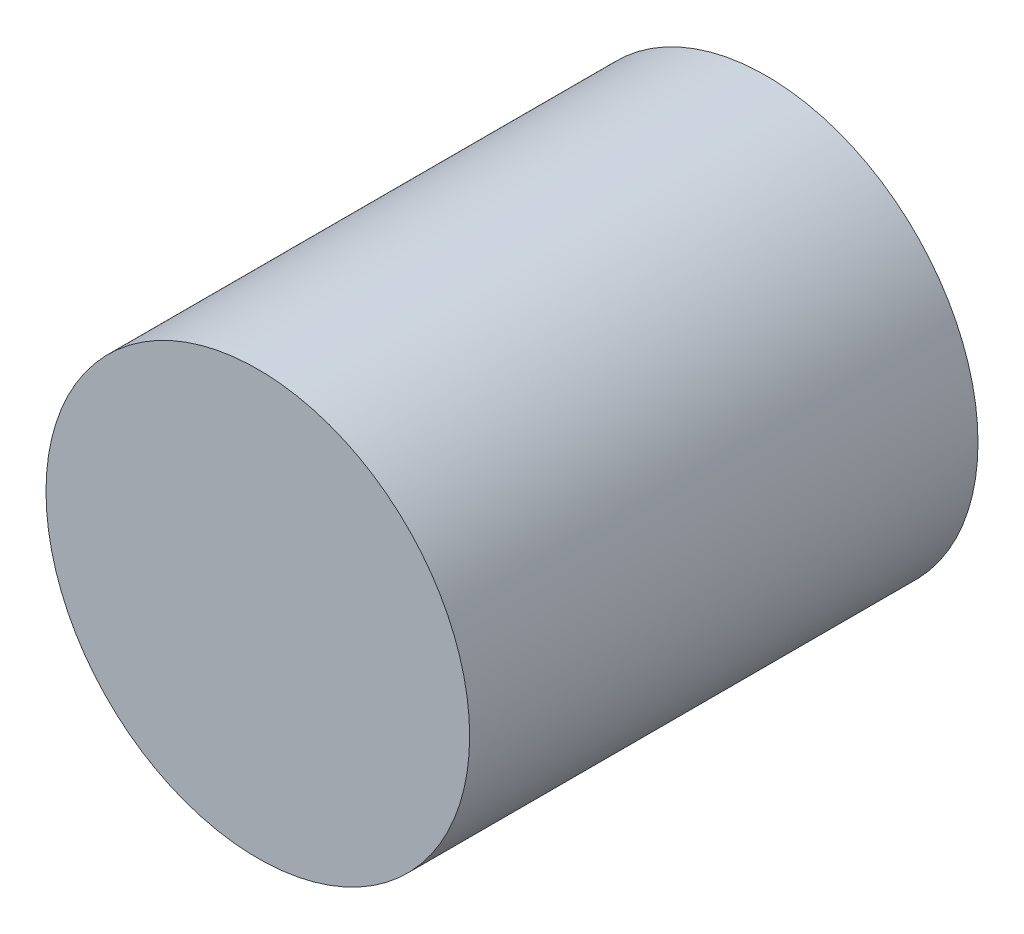
ISO-10303-21;
HEADER;
FILE_DESCRIPTION(('STEP AP214'),'2;1');
FILE_NAME('part.step','',(''),(''),'','','');
FILE_SCHEMA(('AUTOMOTIVE_DESIGN { 1 0 10303 214 1 1 1 1 }'));
ENDSEC;
DATA;
#1=APPLICATION_CONTEXT('core data for automotive mechanical design processes');
#2=APPLICATION_PROTOCOL_DEFINITION('international standard','automotive_design',2000,#1);
#3=PRODUCT_CONTEXT('',#1,'mechanical');
#4=PRODUCT('Part','Part','',(#3));
#5=PRODUCT_RELATED_PRODUCT_CATEGORY('part','',(#4));
#6=PRODUCT_DEFINITION_FORMATION('','',#4);
#7=PRODUCT_DEFINITION_CONTEXT('part definition',#1,'design');
#8=PRODUCT_DEFINITION('design','',#6,#7);
#9=PRODUCT_DEFINITION_SHAPE('','',#8);
#10=(LENGTH_UNIT() NAMED_UNIT(*) SI_UNIT(.MILLI.,.METRE.));
#11=(NAMED_UNIT(*) PLANE_ANGLE_UNIT() SI_UNIT($,.RADIAN.));
#12=(NAMED_UNIT(*) SI_UNIT($,.STERADIAN.) SOLID_ANGLE_UNIT());
#13=UNCERTAINTY_MEASURE_WITH_UNIT(LENGTH_MEASURE(1.E-05),#10,'distance_accuracy_value','');
#14=(GEOMETRIC_REPRESENTATION_CONTEXT(3) GLOBAL_UNCERTAINTY_ASSIGNED_CONTEXT((#13)) GLOBAL_UNIT_ASSIGNED_CONTEXT((#10,
#11,#12)) REPRESENTATION_CONTEXT('',''));
#15=CARTESIAN_POINT('',(0.,0.,0.));
#16=DIRECTION('',(0.,0.,1.));
#17=DIRECTION('',(1.,0.,0.));
#18=AXIS2_PLACEMENT_3D('',#15,#16,#17);
#19=CARTESIAN_POINT('',(8.30011039999987,-9.70008982,7.2500007));
#20=DIRECTION('',(0.,0.,-1.));
#21=DIRECTION('',(-1.,0.,0.));
#22=AXIS2_PLACEMENT_3D('',#19,#20,#21);
#23=PLANE('',#22);
#24=CARTESIAN_POINT('',(8.30011039999987,-7.20008974,7.2500007));
#25=DIRECTION('',(0.,0.,-1.));
#26=DIRECTION('',(-1.,0.,0.));
#27=AXIS2_PLACEMENT_3D('',#24,#25,#26);
#28=CIRCLE('',#27,2.50000008);
#29=CARTESIAN_POINT('',(5.80011031999987,-7.20008974,7.2500007));
#30=VERTEX_POINT('',#29);
#31=EDGE_CURVE('E18',#30,#30,#28,.T.);
#32=ORIENTED_EDGE('',*,*,#31,.F.);
#33=EDGE_LOOP('',(#32));
#34=FACE_BOUND('',#33,.T.);
#35=ADVANCED_FACE('F15',(#34),#23,.F.);
#36=CARTESIAN_POINT('',(8.30011039999987,-9.70008982,1.25));
#37=DIRECTION('',(0.,0.,-1.));
#38=DIRECTION('',(-1.,0.,0.));
#39=AXIS2_PLACEMENT_3D('',#36,#37,#38);
#40=PLANE('',#39);
#41=CARTESIAN_POINT('',(8.30011039999987,-7.20008974,1.25));
#42=DIRECTION('',(0.,0.,-1.));
#43=DIRECTION('',(-1.,0.,0.));
#44=AXIS2_PLACEMENT_3D('',#41,#42,#43);
#45=CIRCLE('',#44,2.50000008);
#46=CARTESIAN_POINT('',(5.80011031999987,-7.20008974,1.25));
#47=VERTEX_POINT('',#46);
#48=EDGE_CURVE('E10',#47,#47,#45,.F.);
#49=ORIENTED_EDGE('',*,*,#48,.F.);
#50=EDGE_LOOP('',(#49));
#51=FACE_BOUND('',#50,.T.);
#52=ADVANCED_FACE('F30',(#51),#40,.T.);
#53=CARTESIAN_POINT('',(8.30011039999987,-7.20008974,1.25));
#54=DIRECTION('',(0.,0.,-1.));
#55=DIRECTION('',(-1.,0.,0.));
#56=AXIS2_PLACEMENT_3D('',#53,#54,#55);
#57=CYLINDRICAL_SURFACE('',#56,2.50000008);
#58=ORIENTED_EDGE('',*,*,#31,.T.);
#59=EDGE_LOOP('',(#58));
#60=FACE_BOUND('',#59,.T.);
#61=ORIENTED_EDGE('',*,*,#48,.T.);
#62=EDGE_LOOP('',(#61));
#63=FACE_BOUND('',#62,.T.);
#64=ADVANCED_FACE('F27',(#60,#63),#57,.T.);
#65=CLOSED_SHELL('',(#35,#52,#64));
#66=MANIFOLD_SOLID_BREP('B1',#65);
#67=ADVANCED_BREP_SHAPE_REPRESENTATION('',(#18,#66),#14);
#68=SHAPE_DEFINITION_REPRESENTATION(#9,#67);
ENDSEC;
END-ISO-10303-21;
